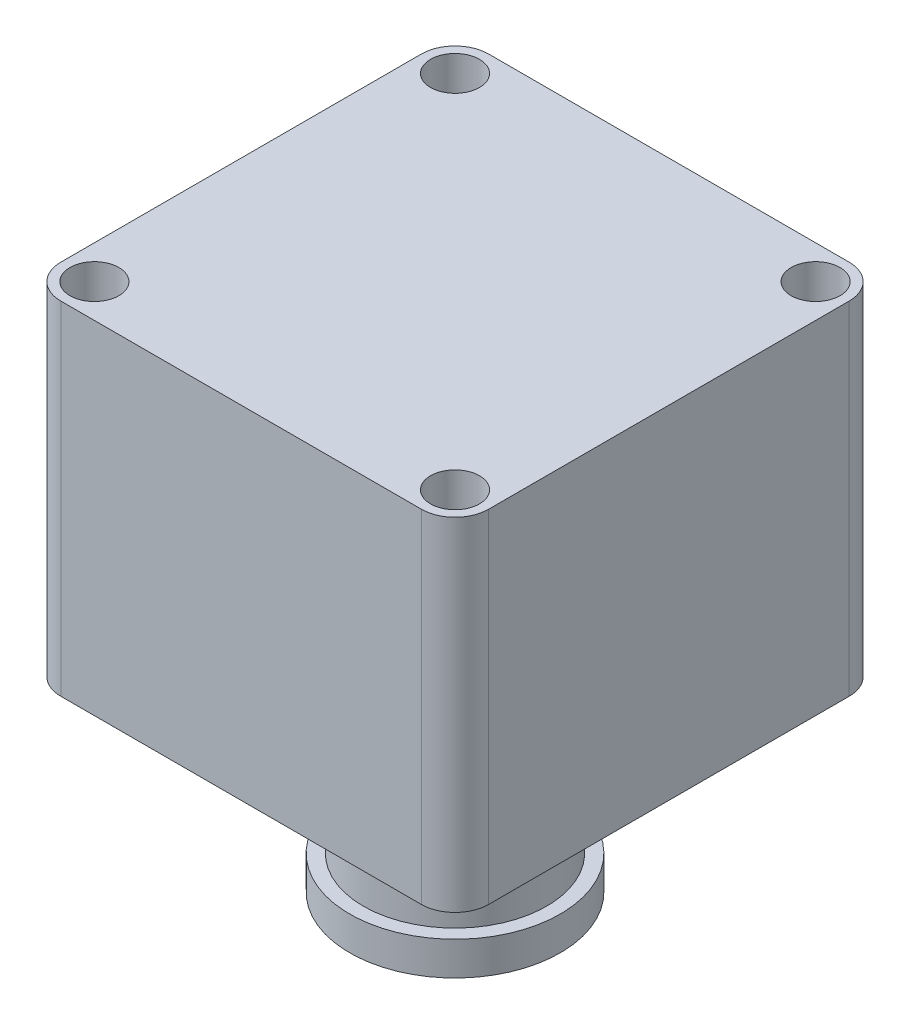
ISO-10303-21;
HEADER;
FILE_DESCRIPTION(('STEP AP214'),'2;1');
FILE_NAME('part.step','',(''),(''),'','','');
FILE_SCHEMA(('AUTOMOTIVE_DESIGN { 1 0 10303 214 1 1 1 1 }'));
ENDSEC;
DATA;
#1=APPLICATION_CONTEXT('core data for automotive mechanical design processes');
#2=APPLICATION_PROTOCOL_DEFINITION('international standard','automotive_design',2000,#1);
#3=PRODUCT_CONTEXT('',#1,'mechanical');
#4=PRODUCT('Part','Part','',(#3));
#5=PRODUCT_RELATED_PRODUCT_CATEGORY('part','',(#4));
#6=PRODUCT_DEFINITION_FORMATION('','',#4);
#7=PRODUCT_DEFINITION_CONTEXT('part definition',#1,'design');
#8=PRODUCT_DEFINITION('design','',#6,#7);
#9=PRODUCT_DEFINITION_SHAPE('','',#8);
#10=(LENGTH_UNIT() NAMED_UNIT(*) SI_UNIT(.MILLI.,.METRE.));
#11=(NAMED_UNIT(*) PLANE_ANGLE_UNIT() SI_UNIT($,.RADIAN.));
#12=(NAMED_UNIT(*) SI_UNIT($,.STERADIAN.) SOLID_ANGLE_UNIT());
#13=UNCERTAINTY_MEASURE_WITH_UNIT(LENGTH_MEASURE(1.E-05),#10,'distance_accuracy_value','');
#14=(GEOMETRIC_REPRESENTATION_CONTEXT(3) GLOBAL_UNCERTAINTY_ASSIGNED_CONTEXT((#13)) GLOBAL_UNIT_ASSIGNED_CONTEXT((#10,
#11,#12)) REPRESENTATION_CONTEXT('',''));
#15=CARTESIAN_POINT('',(0.,0.,0.));
#16=DIRECTION('',(0.,0.,1.));
#17=DIRECTION('',(1.,0.,0.));
#18=AXIS2_PLACEMENT_3D('',#15,#16,#17);
#19=CARTESIAN_POINT('',(-20.2297248454117,56.896,32.9943924375685));
#20=DIRECTION('',(0.,1.,0.));
#21=DIRECTION('',(0.,0.,1.));
#22=AXIS2_PLACEMENT_3D('',#19,#20,#21);
#23=PLANE('',#22);
#24=CARTESIAN_POINT('',(-20.2297248454117,56.896,-26.9496075624315));
#25=DIRECTION('',(0.,1.,0.));
#26=DIRECTION('',(0.,0.,1.));
#27=AXIS2_PLACEMENT_3D('',#24,#25,#26);
#28=CIRCLE('',#27,4.064);
#29=CARTESIAN_POINT('',(-20.2297248454117,56.896,-22.8856075624314));
#30=VERTEX_POINT('',#29);
#31=EDGE_CURVE('E201',#30,#30,#28,.T.);
#32=ORIENTED_EDGE('',*,*,#31,.F.);
#33=EDGE_LOOP('',(#32));
#34=FACE_BOUND('',#33,.T.);
#35=CARTESIAN_POINT('',(-80.1737248454117,56.896,-26.9496075624315));
#36=DIRECTION('',(0.,1.,0.));
#37=DIRECTION('',(0.,0.,1.));
#38=AXIS2_PLACEMENT_3D('',#35,#36,#37);
#39=CIRCLE('',#38,4.064);
#40=CARTESIAN_POINT('',(-80.1737248454117,56.896,-22.8856075624314));
#41=VERTEX_POINT('',#40);
#42=EDGE_CURVE('E143',#41,#41,#39,.T.);
#43=ORIENTED_EDGE('',*,*,#42,.F.);
#44=EDGE_LOOP('',(#43));
#45=FACE_BOUND('',#44,.T.);
#46=CARTESIAN_POINT('',(-20.2297248454117,56.896,32.9943924375685));
#47=DIRECTION('',(0.,1.,0.));
#48=DIRECTION('',(0.,0.,1.));
#49=AXIS2_PLACEMENT_3D('',#46,#47,#48);
#50=CIRCLE('',#49,5.588);
#51=CARTESIAN_POINT('',(-20.2297248454117,56.896,38.5823924375685));
#52=VERTEX_POINT('',#51);
#53=CARTESIAN_POINT('',(-14.6417248454117,56.896,32.9943924375685));
#54=VERTEX_POINT('',#53);
#55=EDGE_CURVE('E154',#52,#54,#50,.T.);
#56=ORIENTED_EDGE('',*,*,#55,.T.);
#57=DIRECTION('',(0.,0.,-1.));
#58=VECTOR('',#57,1.);
#59=CARTESIAN_POINT('',(-14.6417248454117,56.896,-26.9496075624314));
#60=LINE('',#59,#58);
#61=CARTESIAN_POINT('',(-14.6417248454117,56.896,-26.9496075624314));
#62=VERTEX_POINT('',#61);
#63=EDGE_CURVE('E102',#54,#62,#60,.T.);
#64=ORIENTED_EDGE('',*,*,#63,.T.);
#65=CARTESIAN_POINT('',(-20.2297248454117,56.896,-26.9496075624315));
#66=DIRECTION('',(0.,1.,0.));
#67=DIRECTION('',(0.,0.,-1.));
#68=AXIS2_PLACEMENT_3D('',#65,#66,#67);
#69=CIRCLE('',#68,5.588);
#70=CARTESIAN_POINT('',(-20.2297248454117,56.896,-32.5376075624315));
#71=VERTEX_POINT('',#70);
#72=EDGE_CURVE('E186',#62,#71,#69,.T.);
#73=ORIENTED_EDGE('',*,*,#72,.T.);
#74=DIRECTION('',(-1.,0.,0.));
#75=VECTOR('',#74,1.);
#76=CARTESIAN_POINT('',(-80.1737248454117,56.896,-32.5376075624315));
#77=LINE('',#76,#75);
#78=CARTESIAN_POINT('',(-80.1737248454117,56.896,-32.5376075624315));
#79=VERTEX_POINT('',#78);
#80=EDGE_CURVE('E185',#71,#79,#77,.T.);
#81=ORIENTED_EDGE('',*,*,#80,.T.);
#82=CARTESIAN_POINT('',(-80.1737248454117,56.896,-26.9496075624315));
#83=DIRECTION('',(0.,1.,0.));
#84=DIRECTION('',(0.,0.,1.));
#85=AXIS2_PLACEMENT_3D('',#82,#83,#84);
#86=CIRCLE('',#85,5.588);
#87=CARTESIAN_POINT('',(-85.7617248454117,56.896,-26.9496075624314));
#88=VERTEX_POINT('',#87);
#89=EDGE_CURVE('E121',#79,#88,#86,.T.);
#90=ORIENTED_EDGE('',*,*,#89,.T.);
#91=DIRECTION('',(0.,0.,1.));
#92=VECTOR('',#91,1.);
#93=CARTESIAN_POINT('',(-85.7617248454117,56.896,-26.9496075624314));
#94=LINE('',#93,#92);
#95=CARTESIAN_POINT('',(-85.7617248454117,56.896,32.9943924375685));
#96=VERTEX_POINT('',#95);
#97=EDGE_CURVE('E115',#88,#96,#94,.T.);
#98=ORIENTED_EDGE('',*,*,#97,.T.);
#99=CARTESIAN_POINT('',(-80.1737248454117,56.896,32.9943924375685));
#100=DIRECTION('',(0.,1.,0.));
#101=DIRECTION('',(0.,0.,1.));
#102=AXIS2_PLACEMENT_3D('',#99,#100,#101);
#103=CIRCLE('',#102,5.588);
#104=CARTESIAN_POINT('',(-80.1737248454117,56.896,38.5823924375685));
#105=VERTEX_POINT('',#104);
#106=EDGE_CURVE('E119',#96,#105,#103,.T.);
#107=ORIENTED_EDGE('',*,*,#106,.T.);
#108=DIRECTION('',(1.,0.,0.));
#109=VECTOR('',#108,1.);
#110=CARTESIAN_POINT('',(-80.1737248454117,56.896,38.5823924375685));
#111=LINE('',#110,#109);
#112=EDGE_CURVE('E58',#105,#52,#111,.T.);
#113=ORIENTED_EDGE('',*,*,#112,.T.);
#114=EDGE_LOOP('',(#56,#64,#73,#81,#90,#98,#107,#113));
#115=FACE_BOUND('',#114,.T.);
#116=CARTESIAN_POINT('',(-80.1737248454117,56.896,32.9943924375685));
#117=DIRECTION('',(0.,1.,0.));
#118=DIRECTION('',(0.,0.,1.));
#119=AXIS2_PLACEMENT_3D('',#116,#117,#118);
#120=CIRCLE('',#119,4.064);
#121=CARTESIAN_POINT('',(-80.1737248454117,56.896,37.0583924375685));
#122=VERTEX_POINT('',#121);
#123=EDGE_CURVE('E195',#122,#122,#120,.T.);
#124=ORIENTED_EDGE('',*,*,#123,.F.);
#125=EDGE_LOOP('',(#124));
#126=FACE_BOUND('',#125,.T.);
#127=CARTESIAN_POINT('',(-20.2297248454117,56.896,32.9943924375685));
#128=DIRECTION('',(0.,1.,0.));
#129=DIRECTION('',(0.,0.,1.));
#130=AXIS2_PLACEMENT_3D('',#127,#128,#129);
#131=CIRCLE('',#130,4.064);
#132=CARTESIAN_POINT('',(-20.2297248454117,56.896,37.0583924375685));
#133=VERTEX_POINT('',#132);
#134=EDGE_CURVE('E207',#133,#133,#131,.T.);
#135=ORIENTED_EDGE('',*,*,#134,.F.);
#136=EDGE_LOOP('',(#135));
#137=FACE_BOUND('',#136,.T.);
#138=ADVANCED_FACE('F41',(#34,#45,#115,#126,#137),#23,.T.);
#139=CARTESIAN_POINT('',(-20.2297248454117,0.,32.9943924375685));
#140=DIRECTION('',(0.,1.,0.));
#141=DIRECTION('',(0.,0.,1.));
#142=AXIS2_PLACEMENT_3D('',#139,#140,#141);
#143=PLANE('',#142);
#144=CARTESIAN_POINT('',(-50.2017248454117,0.,3.02239243756854));
#145=DIRECTION('',(0.,1.,0.));
#146=DIRECTION('',(0.,0.,1.));
#147=AXIS2_PLACEMENT_3D('',#144,#145,#146);
#148=CIRCLE('',#147,15.24);
#149=CARTESIAN_POINT('',(-50.2017248454117,0.,18.2623924375685));
#150=VERTEX_POINT('',#149);
#151=EDGE_CURVE('E11',#150,#150,#148,.F.);
#152=ORIENTED_EDGE('',*,*,#151,.F.);
#153=EDGE_LOOP('',(#152));
#154=FACE_BOUND('',#153,.T.);
#155=CARTESIAN_POINT('',(-20.2297248454117,0.,32.9943924375685));
#156=DIRECTION('',(0.,1.,0.));
#157=DIRECTION('',(0.,0.,1.));
#158=AXIS2_PLACEMENT_3D('',#155,#156,#157);
#159=CIRCLE('',#158,5.588);
#160=CARTESIAN_POINT('',(-20.2297248454117,0.,38.5823924375685));
#161=VERTEX_POINT('',#160);
#162=CARTESIAN_POINT('',(-14.6417248454117,0.,32.9943924375685));
#163=VERTEX_POINT('',#162);
#164=EDGE_CURVE('E139',#161,#163,#159,.T.);
#165=ORIENTED_EDGE('',*,*,#164,.F.);
#166=DIRECTION('',(1.,0.,0.));
#167=VECTOR('',#166,1.);
#168=CARTESIAN_POINT('',(-80.1737248454117,0.,38.5823924375685));
#169=LINE('',#168,#167);
#170=CARTESIAN_POINT('',(-80.1737248454117,0.,38.5823924375685));
#171=VERTEX_POINT('',#170);
#172=EDGE_CURVE('E93',#171,#161,#169,.T.);
#173=ORIENTED_EDGE('',*,*,#172,.F.);
#174=CARTESIAN_POINT('',(-80.1737248454117,0.,32.9943924375685));
#175=DIRECTION('',(0.,1.,0.));
#176=DIRECTION('',(0.,0.,1.));
#177=AXIS2_PLACEMENT_3D('',#174,#175,#176);
#178=CIRCLE('',#177,5.588);
#179=CARTESIAN_POINT('',(-85.7617248454117,0.,32.9943924375685));
#180=VERTEX_POINT('',#179);
#181=EDGE_CURVE('E87',#180,#171,#178,.T.);
#182=ORIENTED_EDGE('',*,*,#181,.F.);
#183=DIRECTION('',(0.,0.,1.));
#184=VECTOR('',#183,1.);
#185=CARTESIAN_POINT('',(-85.7617248454117,0.,-26.9496075624314));
#186=LINE('',#185,#184);
#187=CARTESIAN_POINT('',(-85.7617248454117,0.,-26.9496075624314));
#188=VERTEX_POINT('',#187);
#189=EDGE_CURVE('E129',#188,#180,#186,.T.);
#190=ORIENTED_EDGE('',*,*,#189,.F.);
#191=CARTESIAN_POINT('',(-80.1737248454117,0.,-26.9496075624315));
#192=DIRECTION('',(0.,1.,0.));
#193=DIRECTION('',(0.,0.,1.));
#194=AXIS2_PLACEMENT_3D('',#191,#192,#193);
#195=CIRCLE('',#194,5.588);
#196=CARTESIAN_POINT('',(-80.1737248454117,0.,-32.5376075624315));
#197=VERTEX_POINT('',#196);
#198=EDGE_CURVE('E149',#197,#188,#195,.T.);
#199=ORIENTED_EDGE('',*,*,#198,.F.);
#200=DIRECTION('',(-1.,0.,0.));
#201=VECTOR('',#200,1.);
#202=CARTESIAN_POINT('',(-80.1737248454117,0.,-32.5376075624315));
#203=LINE('',#202,#201);
#204=CARTESIAN_POINT('',(-20.2297248454117,0.,-32.5376075624315));
#205=VERTEX_POINT('',#204);
#206=EDGE_CURVE('E147',#205,#197,#203,.T.);
#207=ORIENTED_EDGE('',*,*,#206,.F.);
#208=CARTESIAN_POINT('',(-20.2297248454117,0.,-26.9496075624315));
#209=DIRECTION('',(0.,1.,0.));
#210=DIRECTION('',(0.,0.,-1.));
#211=AXIS2_PLACEMENT_3D('',#208,#209,#210);
#212=CIRCLE('',#211,5.588);
#213=CARTESIAN_POINT('',(-14.6417248454117,0.,-26.9496075624314));
#214=VERTEX_POINT('',#213);
#215=EDGE_CURVE('E145',#214,#205,#212,.T.);
#216=ORIENTED_EDGE('',*,*,#215,.F.);
#217=DIRECTION('',(0.,0.,-1.));
#218=VECTOR('',#217,1.);
#219=CARTESIAN_POINT('',(-14.6417248454117,0.,-26.9496075624314));
#220=LINE('',#219,#218);
#221=EDGE_CURVE('E142',#163,#214,#220,.T.);
#222=ORIENTED_EDGE('',*,*,#221,.F.);
#223=EDGE_LOOP('',(#165,#173,#182,#190,#199,#207,#216,#222));
#224=FACE_BOUND('',#223,.T.);
#225=CARTESIAN_POINT('',(-80.1737248454117,0.,-26.9496075624315));
#226=DIRECTION('',(0.,1.,0.));
#227=DIRECTION('',(0.,0.,1.));
#228=AXIS2_PLACEMENT_3D('',#225,#226,#227);
#229=CIRCLE('',#228,4.064);
#230=CARTESIAN_POINT('',(-80.1737248454117,0.,-22.8856075624314));
#231=VERTEX_POINT('',#230);
#232=EDGE_CURVE('E192',#231,#231,#229,.T.);
#233=ORIENTED_EDGE('',*,*,#232,.T.);
#234=EDGE_LOOP('',(#233));
#235=FACE_BOUND('',#234,.T.);
#236=CARTESIAN_POINT('',(-80.1737248454117,0.,32.9943924375685));
#237=DIRECTION('',(0.,1.,0.));
#238=DIRECTION('',(0.,0.,1.));
#239=AXIS2_PLACEMENT_3D('',#236,#237,#238);
#240=CIRCLE('',#239,4.064);
#241=CARTESIAN_POINT('',(-80.1737248454117,0.,37.0583924375685));
#242=VERTEX_POINT('',#241);
#243=EDGE_CURVE('E198',#242,#242,#240,.T.);
#244=ORIENTED_EDGE('',*,*,#243,.T.);
#245=EDGE_LOOP('',(#244));
#246=FACE_BOUND('',#245,.T.);
#247=CARTESIAN_POINT('',(-20.2297248454117,0.,-26.9496075624315));
#248=DIRECTION('',(0.,1.,0.));
#249=DIRECTION('',(0.,0.,1.));
#250=AXIS2_PLACEMENT_3D('',#247,#248,#249);
#251=CIRCLE('',#250,4.064);
#252=CARTESIAN_POINT('',(-20.2297248454117,0.,-22.8856075624314));
#253=VERTEX_POINT('',#252);
#254=EDGE_CURVE('E204',#253,#253,#251,.T.);
#255=ORIENTED_EDGE('',*,*,#254,.T.);
#256=EDGE_LOOP('',(#255));
#257=FACE_BOUND('',#256,.T.);
#258=CARTESIAN_POINT('',(-20.2297248454117,0.,32.9943924375685));
#259=DIRECTION('',(0.,1.,0.));
#260=DIRECTION('',(0.,0.,1.));
#261=AXIS2_PLACEMENT_3D('',#258,#259,#260);
#262=CIRCLE('',#261,4.064);
#263=CARTESIAN_POINT('',(-20.2297248454117,0.,37.0583924375685));
#264=VERTEX_POINT('',#263);
#265=EDGE_CURVE('E210',#264,#264,#262,.T.);
#266=ORIENTED_EDGE('',*,*,#265,.T.);
#267=EDGE_LOOP('',(#266));
#268=FACE_BOUND('',#267,.T.);
#269=ADVANCED_FACE('F172',(#154,#224,#235,#246,#257,#268),#143,.F.);
#270=CARTESIAN_POINT('',(-20.2297248454117,56.896,32.9943924375685));
#271=DIRECTION('',(0.,-1.,0.));
#272=DIRECTION('',(0.,0.,-1.));
#273=AXIS2_PLACEMENT_3D('',#270,#271,#272);
#274=CYLINDRICAL_SURFACE('',#273,5.588);
#275=ORIENTED_EDGE('',*,*,#164,.T.);
#276=DIRECTION('',(0.,-1.,0.));
#277=VECTOR('',#276,1.);
#278=CARTESIAN_POINT('',(-14.6417248454117,56.896,32.9943924375685));
#279=LINE('',#278,#277);
#280=EDGE_CURVE('E50',#54,#163,#279,.T.);
#281=ORIENTED_EDGE('',*,*,#280,.F.);
#282=ORIENTED_EDGE('',*,*,#55,.F.);
#283=DIRECTION('',(0.,-1.,0.));
#284=VECTOR('',#283,1.);
#285=CARTESIAN_POINT('',(-20.2297248454117,56.896,38.5823924375685));
#286=LINE('',#285,#284);
#287=EDGE_CURVE('E135',#52,#161,#286,.T.);
#288=ORIENTED_EDGE('',*,*,#287,.T.);
#289=EDGE_LOOP('',(#275,#281,#282,#288));
#290=FACE_BOUND('',#289,.T.);
#291=ADVANCED_FACE('F43',(#290),#274,.T.);
#292=CARTESIAN_POINT('',(-14.6417248454117,56.896,-26.9496075624314));
#293=DIRECTION('',(-1.,0.,0.));
#294=DIRECTION('',(0.,0.,1.));
#295=AXIS2_PLACEMENT_3D('',#292,#293,#294);
#296=PLANE('',#295);
#297=ORIENTED_EDGE('',*,*,#221,.T.);
#298=DIRECTION('',(0.,-1.,0.));
#299=VECTOR('',#298,1.);
#300=CARTESIAN_POINT('',(-14.6417248454117,56.896,-26.9496075624314));
#301=LINE('',#300,#299);
#302=EDGE_CURVE('E164',#62,#214,#301,.T.);
#303=ORIENTED_EDGE('',*,*,#302,.F.);
#304=ORIENTED_EDGE('',*,*,#63,.F.);
#305=ORIENTED_EDGE('',*,*,#280,.T.);
#306=EDGE_LOOP('',(#297,#303,#304,#305));
#307=FACE_BOUND('',#306,.T.);
#308=ADVANCED_FACE('F167',(#307),#296,.F.);
#309=CARTESIAN_POINT('',(-20.2297248454117,56.896,-26.9496075624315));
#310=DIRECTION('',(0.,-1.,0.));
#311=DIRECTION('',(0.,0.,-1.));
#312=AXIS2_PLACEMENT_3D('',#309,#310,#311);
#313=CYLINDRICAL_SURFACE('',#312,5.588);
#314=ORIENTED_EDGE('',*,*,#215,.T.);
#315=DIRECTION('',(0.,-1.,0.));
#316=VECTOR('',#315,1.);
#317=CARTESIAN_POINT('',(-20.2297248454117,56.896,-32.5376075624315));
#318=LINE('',#317,#316);
#319=EDGE_CURVE('E161',#71,#205,#318,.T.);
#320=ORIENTED_EDGE('',*,*,#319,.F.);
#321=ORIENTED_EDGE('',*,*,#72,.F.);
#322=ORIENTED_EDGE('',*,*,#302,.T.);
#323=EDGE_LOOP('',(#314,#320,#321,#322));
#324=FACE_BOUND('',#323,.T.);
#325=ADVANCED_FACE('F179',(#324),#313,.T.);
#326=CARTESIAN_POINT('',(-80.1737248454117,56.896,-32.5376075624315));
#327=DIRECTION('',(0.,0.,1.));
#328=DIRECTION('',(1.,0.,0.));
#329=AXIS2_PLACEMENT_3D('',#326,#327,#328);
#330=PLANE('',#329);
#331=ORIENTED_EDGE('',*,*,#206,.T.);
#332=DIRECTION('',(0.,-1.,0.));
#333=VECTOR('',#332,1.);
#334=CARTESIAN_POINT('',(-80.1737248454117,56.896,-32.5376075624315));
#335=LINE('',#334,#333);
#336=EDGE_CURVE('E158',#79,#197,#335,.T.);
#337=ORIENTED_EDGE('',*,*,#336,.F.);
#338=ORIENTED_EDGE('',*,*,#80,.F.);
#339=ORIENTED_EDGE('',*,*,#319,.T.);
#340=EDGE_LOOP('',(#331,#337,#338,#339));
#341=FACE_BOUND('',#340,.T.);
#342=ADVANCED_FACE('F183',(#341),#330,.F.);
#343=CARTESIAN_POINT('',(-80.1737248454117,56.896,-26.9496075624315));
#344=DIRECTION('',(0.,-1.,0.));
#345=DIRECTION('',(0.,0.,-1.));
#346=AXIS2_PLACEMENT_3D('',#343,#344,#345);
#347=CYLINDRICAL_SURFACE('',#346,5.588);
#348=ORIENTED_EDGE('',*,*,#198,.T.);
#349=DIRECTION('',(0.,-1.,0.));
#350=VECTOR('',#349,1.);
#351=CARTESIAN_POINT('',(-85.7617248454117,56.896,-26.9496075624314));
#352=LINE('',#351,#350);
#353=EDGE_CURVE('E130',#88,#188,#352,.T.);
#354=ORIENTED_EDGE('',*,*,#353,.F.);
#355=ORIENTED_EDGE('',*,*,#89,.F.);
#356=ORIENTED_EDGE('',*,*,#336,.T.);
#357=EDGE_LOOP('',(#348,#354,#355,#356));
#358=FACE_BOUND('',#357,.T.);
#359=ADVANCED_FACE('F264',(#358),#347,.T.);
#360=CARTESIAN_POINT('',(-85.7617248454117,56.896,-26.9496075624314));
#361=DIRECTION('',(1.,0.,0.));
#362=DIRECTION('',(0.,0.,-1.));
#363=AXIS2_PLACEMENT_3D('',#360,#361,#362);
#364=PLANE('',#363);
#365=ORIENTED_EDGE('',*,*,#189,.T.);
#366=DIRECTION('',(0.,-1.,0.));
#367=VECTOR('',#366,1.);
#368=CARTESIAN_POINT('',(-85.7617248454117,56.896,32.9943924375685));
#369=LINE('',#368,#367);
#370=EDGE_CURVE('E126',#96,#180,#369,.T.);
#371=ORIENTED_EDGE('',*,*,#370,.F.);
#372=ORIENTED_EDGE('',*,*,#97,.F.);
#373=ORIENTED_EDGE('',*,*,#353,.T.);
#374=EDGE_LOOP('',(#365,#371,#372,#373));
#375=FACE_BOUND('',#374,.T.);
#376=ADVANCED_FACE('F127',(#375),#364,.F.);
#377=CARTESIAN_POINT('',(-80.1737248454117,56.896,32.9943924375685));
#378=DIRECTION('',(0.,-1.,0.));
#379=DIRECTION('',(0.,0.,-1.));
#380=AXIS2_PLACEMENT_3D('',#377,#378,#379);
#381=CYLINDRICAL_SURFACE('',#380,5.588);
#382=ORIENTED_EDGE('',*,*,#181,.T.);
#383=DIRECTION('',(0.,-1.,0.));
#384=VECTOR('',#383,1.);
#385=CARTESIAN_POINT('',(-80.1737248454117,56.896,38.5823924375685));
#386=LINE('',#385,#384);
#387=EDGE_CURVE('E131',#105,#171,#386,.T.);
#388=ORIENTED_EDGE('',*,*,#387,.F.);
#389=ORIENTED_EDGE('',*,*,#106,.F.);
#390=ORIENTED_EDGE('',*,*,#370,.T.);
#391=EDGE_LOOP('',(#382,#388,#389,#390));
#392=FACE_BOUND('',#391,.T.);
#393=ADVANCED_FACE('F133',(#392),#381,.T.);
#394=CARTESIAN_POINT('',(-80.1737248454117,56.896,38.5823924375685));
#395=DIRECTION('',(0.,0.,-1.));
#396=DIRECTION('',(-1.,0.,0.));
#397=AXIS2_PLACEMENT_3D('',#394,#395,#396);
#398=PLANE('',#397);
#399=ORIENTED_EDGE('',*,*,#172,.T.);
#400=ORIENTED_EDGE('',*,*,#287,.F.);
#401=ORIENTED_EDGE('',*,*,#112,.F.);
#402=ORIENTED_EDGE('',*,*,#387,.T.);
#403=EDGE_LOOP('',(#399,#400,#401,#402));
#404=FACE_BOUND('',#403,.T.);
#405=ADVANCED_FACE('F257',(#404),#398,.F.);
#406=CARTESIAN_POINT('',(-80.1737248454117,56.896,-26.9496075624315));
#407=DIRECTION('',(0.,-1.,0.));
#408=DIRECTION('',(0.,0.,-1.));
#409=AXIS2_PLACEMENT_3D('',#406,#407,#408);
#410=CYLINDRICAL_SURFACE('',#409,4.064);
#411=ORIENTED_EDGE('',*,*,#42,.T.);
#412=EDGE_LOOP('',(#411));
#413=FACE_BOUND('',#412,.T.);
#414=ORIENTED_EDGE('',*,*,#232,.F.);
#415=EDGE_LOOP('',(#414));
#416=FACE_BOUND('',#415,.T.);
#417=ADVANCED_FACE('F254',(#413,#416),#410,.F.);
#418=CARTESIAN_POINT('',(-80.1737248454117,56.896,32.9943924375685));
#419=DIRECTION('',(0.,-1.,0.));
#420=DIRECTION('',(0.,0.,-1.));
#421=AXIS2_PLACEMENT_3D('',#418,#419,#420);
#422=CYLINDRICAL_SURFACE('',#421,4.064);
#423=ORIENTED_EDGE('',*,*,#123,.T.);
#424=EDGE_LOOP('',(#423));
#425=FACE_BOUND('',#424,.T.);
#426=ORIENTED_EDGE('',*,*,#243,.F.);
#427=EDGE_LOOP('',(#426));
#428=FACE_BOUND('',#427,.T.);
#429=ADVANCED_FACE('F330',(#425,#428),#422,.F.);
#430=CARTESIAN_POINT('',(-20.2297248454117,56.896,-26.9496075624315));
#431=DIRECTION('',(0.,-1.,0.));
#432=DIRECTION('',(0.,0.,-1.));
#433=AXIS2_PLACEMENT_3D('',#430,#431,#432);
#434=CYLINDRICAL_SURFACE('',#433,4.064);
#435=ORIENTED_EDGE('',*,*,#31,.T.);
#436=EDGE_LOOP('',(#435));
#437=FACE_BOUND('',#436,.T.);
#438=ORIENTED_EDGE('',*,*,#254,.F.);
#439=EDGE_LOOP('',(#438));
#440=FACE_BOUND('',#439,.T.);
#441=ADVANCED_FACE('F339',(#437,#440),#434,.F.);
#442=CARTESIAN_POINT('',(-20.2297248454117,56.896,32.9943924375685));
#443=DIRECTION('',(0.,-1.,0.));
#444=DIRECTION('',(0.,0.,-1.));
#445=AXIS2_PLACEMENT_3D('',#442,#443,#444);
#446=CYLINDRICAL_SURFACE('',#445,4.064);
#447=ORIENTED_EDGE('',*,*,#134,.T.);
#448=EDGE_LOOP('',(#447));
#449=FACE_BOUND('',#448,.T.);
#450=ORIENTED_EDGE('',*,*,#265,.F.);
#451=EDGE_LOOP('',(#450));
#452=FACE_BOUND('',#451,.T.);
#453=ADVANCED_FACE('F348',(#449,#452),#446,.F.);
#454=CARTESIAN_POINT('',(-50.2017248454117,-25.4,3.02239243756854));
#455=DIRECTION('',(0.,1.,0.));
#456=DIRECTION('',(0.,0.,1.));
#457=AXIS2_PLACEMENT_3D('',#454,#455,#456);
#458=CYLINDRICAL_SURFACE('',#457,15.24);
#459=CARTESIAN_POINT('',(-50.2017248454117,-25.4,3.02239243756854));
#460=DIRECTION('',(0.,-1.,0.));
#461=DIRECTION('',(0.,0.,-1.));
#462=AXIS2_PLACEMENT_3D('',#459,#460,#461);
#463=CIRCLE('',#462,15.24);
#464=CARTESIAN_POINT('',(-50.2017248454117,-25.4,-12.2176075624315));
#465=VERTEX_POINT('',#464);
#466=EDGE_CURVE('E213',#465,#465,#463,.T.);
#467=ORIENTED_EDGE('',*,*,#466,.F.);
#468=EDGE_LOOP('',(#467));
#469=FACE_BOUND('',#468,.T.);
#470=ORIENTED_EDGE('',*,*,#151,.T.);
#471=EDGE_LOOP('',(#470));
#472=FACE_BOUND('',#471,.T.);
#473=ADVANCED_FACE('F230',(#469,#472),#458,.T.);
#474=CARTESIAN_POINT('',(-50.2017248454117,-30.988,3.02239243756854));
#475=DIRECTION('',(0.,1.,0.));
#476=DIRECTION('',(0.,0.,1.));
#477=AXIS2_PLACEMENT_3D('',#474,#475,#476);
#478=CYLINDRICAL_SURFACE('',#477,17.5015608380617);
#479=CARTESIAN_POINT('',(-50.2017248454117,-30.988,3.02239243756854));
#480=DIRECTION('',(0.,-1.,0.));
#481=DIRECTION('',(0.,0.,-1.));
#482=AXIS2_PLACEMENT_3D('',#479,#480,#481);
#483=CIRCLE('',#482,17.5015608380617);
#484=CARTESIAN_POINT('',(-50.2017248454117,-30.988,-14.4791684004932));
#485=VERTEX_POINT('',#484);
#486=EDGE_CURVE('E218',#485,#485,#483,.T.);
#487=ORIENTED_EDGE('',*,*,#486,.F.);
#488=EDGE_LOOP('',(#487));
#489=FACE_BOUND('',#488,.T.);
#490=CARTESIAN_POINT('',(-50.2017248454117,-25.4,3.02239243756854));
#491=DIRECTION('',(0.,-1.,0.));
#492=DIRECTION('',(0.,0.,-1.));
#493=AXIS2_PLACEMENT_3D('',#490,#491,#492);
#494=CIRCLE('',#493,17.5015608380617);
#495=CARTESIAN_POINT('',(-50.2017248454117,-25.4,-14.4791684004932));
#496=VERTEX_POINT('',#495);
#497=EDGE_CURVE('E219',#496,#496,#494,.T.);
#498=ORIENTED_EDGE('',*,*,#497,.T.);
#499=EDGE_LOOP('',(#498));
#500=FACE_BOUND('',#499,.T.);
#501=ADVANCED_FACE('F227',(#489,#500),#478,.T.);
#502=CARTESIAN_POINT('',(-50.2017248454117,-30.988,3.02239243756854));
#503=DIRECTION('',(0.,-1.,0.));
#504=DIRECTION('',(0.,0.,-1.));
#505=AXIS2_PLACEMENT_3D('',#502,#503,#504);
#506=PLANE('',#505);
#507=ORIENTED_EDGE('',*,*,#486,.T.);
#508=EDGE_LOOP('',(#507));
#509=FACE_BOUND('',#508,.T.);
#510=ADVANCED_FACE('F225',(#509),#506,.T.);
#511=CARTESIAN_POINT('',(-50.2017248454117,-25.4,3.02239243756854));
#512=DIRECTION('',(0.,-1.,0.));
#513=DIRECTION('',(0.,0.,-1.));
#514=AXIS2_PLACEMENT_3D('',#511,#512,#513);
#515=PLANE('',#514);
#516=ORIENTED_EDGE('',*,*,#466,.T.);
#517=EDGE_LOOP('',(#516));
#518=FACE_BOUND('',#517,.T.);
#519=ORIENTED_EDGE('',*,*,#497,.F.);
#520=EDGE_LOOP('',(#519));
#521=FACE_BOUND('',#520,.T.);
#522=ADVANCED_FACE('F234',(#518,#521),#515,.F.);
#523=CLOSED_SHELL('',(#138,#269,#291,#308,#325,#342,#359,#376,#393,#405,#417,#429,#441,#453,
#473,#501,#510,#522));
#524=MANIFOLD_SOLID_BREP('B2',#523);
#525=ADVANCED_BREP_SHAPE_REPRESENTATION('',(#18,#524),#14);
#526=SHAPE_DEFINITION_REPRESENTATION(#9,#525);
ENDSEC;
END-ISO-10303-21;
